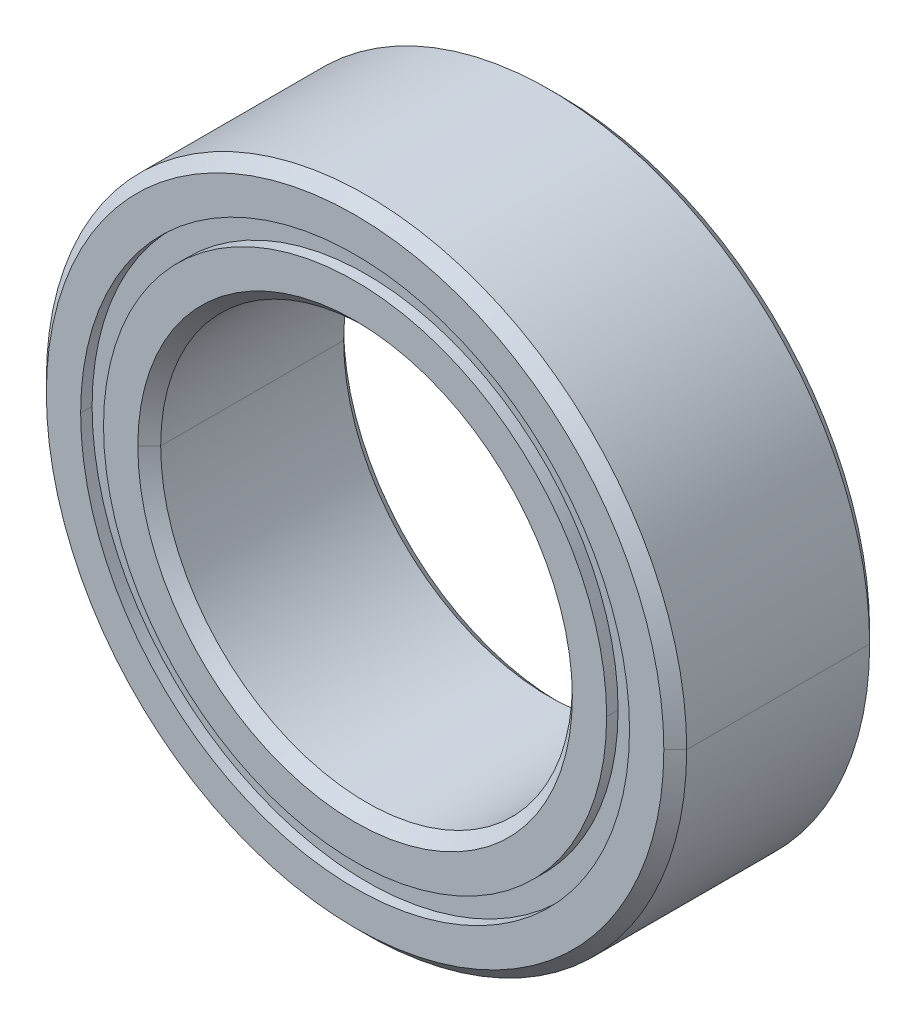
ISO-10303-21;
HEADER;
FILE_DESCRIPTION(('STEP AP214'),'2;1');
FILE_NAME('part.step','',(''),(''),'','','');
FILE_SCHEMA(('AUTOMOTIVE_DESIGN { 1 0 10303 214 1 1 1 1 }'));
ENDSEC;
DATA;
#1=APPLICATION_CONTEXT('core data for automotive mechanical design processes');
#2=APPLICATION_PROTOCOL_DEFINITION('international standard','automotive_design',2000,#1);
#3=PRODUCT_CONTEXT('',#1,'mechanical');
#4=PRODUCT('Part','Part','',(#3));
#5=PRODUCT_RELATED_PRODUCT_CATEGORY('part','',(#4));
#6=PRODUCT_DEFINITION_FORMATION('','',#4);
#7=PRODUCT_DEFINITION_CONTEXT('part definition',#1,'design');
#8=PRODUCT_DEFINITION('design','',#6,#7);
#9=PRODUCT_DEFINITION_SHAPE('','',#8);
#10=(LENGTH_UNIT() NAMED_UNIT(*) SI_UNIT(.MILLI.,.METRE.));
#11=(NAMED_UNIT(*) PLANE_ANGLE_UNIT() SI_UNIT($,.RADIAN.));
#12=(NAMED_UNIT(*) SI_UNIT($,.STERADIAN.) SOLID_ANGLE_UNIT());
#13=UNCERTAINTY_MEASURE_WITH_UNIT(LENGTH_MEASURE(1.E-05),#10,'distance_accuracy_value','');
#14=(GEOMETRIC_REPRESENTATION_CONTEXT(3) GLOBAL_UNCERTAINTY_ASSIGNED_CONTEXT((#13)) GLOBAL_UNIT_ASSIGNED_CONTEXT((#10,
#11,#12)) REPRESENTATION_CONTEXT('',''));
#15=CARTESIAN_POINT('',(0.,0.,0.));
#16=DIRECTION('',(0.,0.,1.));
#17=DIRECTION('',(1.,0.,0.));
#18=AXIS2_PLACEMENT_3D('',#15,#16,#17);
#19=CARTESIAN_POINT('',(0.,0.,2.25));
#20=DIRECTION('',(0.,0.,-1.));
#21=DIRECTION('',(-1.,0.,0.));
#22=AXIS2_PLACEMENT_3D('',#19,#20,#21);
#23=CONICAL_SURFACE('',#22,6.75,0.785398163397445);
#24=DIRECTION('',(0.707106781186545,0.,-0.70710678118655));
#25=VECTOR('',#24,1.);
#26=CARTESIAN_POINT('',(6.75,0.,2.25));
#27=LINE('',#26,#25);
#28=CARTESIAN_POINT('',(6.75,0.,2.25));
#29=VERTEX_POINT('',#28);
#30=CARTESIAN_POINT('',(7.,0.,2.));
#31=VERTEX_POINT('',#30);
#32=EDGE_CURVE('E227',#29,#31,#27,.T.);
#33=ORIENTED_EDGE('',*,*,#32,.F.);
#34=CARTESIAN_POINT('',(0.,0.,2.25));
#35=DIRECTION('',(0.,0.,1.));
#36=DIRECTION('',(1.,0.,0.));
#37=AXIS2_PLACEMENT_3D('',#34,#35,#36);
#38=CIRCLE('',#37,6.75);
#39=CARTESIAN_POINT('',(-6.75,0.,2.25));
#40=VERTEX_POINT('',#39);
#41=EDGE_CURVE('E201',#40,#29,#38,.T.);
#42=ORIENTED_EDGE('',*,*,#41,.F.);
#43=DIRECTION('',(-0.707106781186545,0.,-0.70710678118655));
#44=VECTOR('',#43,1.);
#45=CARTESIAN_POINT('',(-6.75,0.,2.25));
#46=LINE('',#45,#44);
#47=CARTESIAN_POINT('',(-7.,0.,2.));
#48=VERTEX_POINT('',#47);
#49=EDGE_CURVE('E241',#40,#48,#46,.T.);
#50=ORIENTED_EDGE('',*,*,#49,.T.);
#51=CARTESIAN_POINT('',(0.,0.,2.));
#52=DIRECTION('',(0.,0.,-1.));
#53=DIRECTION('',(1.,0.,0.));
#54=AXIS2_PLACEMENT_3D('',#51,#52,#53);
#55=CIRCLE('',#54,7.);
#56=EDGE_CURVE('E122',#31,#48,#55,.T.);
#57=ORIENTED_EDGE('',*,*,#56,.F.);
#58=EDGE_LOOP('',(#33,#42,#50,#57));
#59=FACE_BOUND('',#58,.T.);
#60=ADVANCED_FACE('F17',(#59),#23,.T.);
#61=CARTESIAN_POINT('',(0.,0.,-2.));
#62=DIRECTION('',(0.,0.,1.));
#63=DIRECTION('',(1.,0.,0.));
#64=AXIS2_PLACEMENT_3D('',#61,#62,#63);
#65=CONICAL_SURFACE('',#64,7.,0.78539816339745);
#66=DIRECTION('',(-0.707106781186549,0.,0.707106781186546));
#67=VECTOR('',#66,1.);
#68=CARTESIAN_POINT('',(-7.,0.,-2.));
#69=LINE('',#68,#67);
#70=CARTESIAN_POINT('',(-6.75,0.,-2.25));
#71=VERTEX_POINT('',#70);
#72=CARTESIAN_POINT('',(-7.,0.,-2.));
#73=VERTEX_POINT('',#72);
#74=EDGE_CURVE('E147',#71,#73,#69,.T.);
#75=ORIENTED_EDGE('',*,*,#74,.F.);
#76=CARTESIAN_POINT('',(0.,0.,-2.25));
#77=DIRECTION('',(0.,0.,-1.));
#78=DIRECTION('',(1.,0.,0.));
#79=AXIS2_PLACEMENT_3D('',#76,#77,#78);
#80=CIRCLE('',#79,6.75);
#81=CARTESIAN_POINT('',(6.75,0.,-2.25));
#82=VERTEX_POINT('',#81);
#83=EDGE_CURVE('E139',#82,#71,#80,.T.);
#84=ORIENTED_EDGE('',*,*,#83,.F.);
#85=DIRECTION('',(0.707106781186549,0.,0.707106781186546));
#86=VECTOR('',#85,1.);
#87=CARTESIAN_POINT('',(7.,0.,-2.));
#88=LINE('',#87,#86);
#89=CARTESIAN_POINT('',(7.,0.,-2.));
#90=VERTEX_POINT('',#89);
#91=EDGE_CURVE('E136',#82,#90,#88,.T.);
#92=ORIENTED_EDGE('',*,*,#91,.T.);
#93=CARTESIAN_POINT('',(0.,0.,-2.));
#94=DIRECTION('',(0.,0.,1.));
#95=DIRECTION('',(1.,0.,0.));
#96=AXIS2_PLACEMENT_3D('',#93,#94,#95);
#97=CIRCLE('',#96,7.);
#98=EDGE_CURVE('E108',#73,#90,#97,.T.);
#99=ORIENTED_EDGE('',*,*,#98,.F.);
#100=EDGE_LOOP('',(#75,#84,#92,#99));
#101=FACE_BOUND('',#100,.T.);
#102=ADVANCED_FACE('F137',(#101),#65,.T.);
#103=CARTESIAN_POINT('',(0.,0.,2.));
#104=DIRECTION('',(0.,0.,1.));
#105=DIRECTION('',(1.,0.,0.));
#106=AXIS2_PLACEMENT_3D('',#103,#104,#105);
#107=CONICAL_SURFACE('',#106,4.5,0.785398163397452);
#108=DIRECTION('',(-0.70710678118655,0.,0.707106781186545));
#109=VECTOR('',#108,1.);
#110=CARTESIAN_POINT('',(-4.5,0.,2.));
#111=LINE('',#110,#109);
#112=CARTESIAN_POINT('',(-4.5,0.,2.));
#113=VERTEX_POINT('',#112);
#114=CARTESIAN_POINT('',(-4.75,0.,2.25));
#115=VERTEX_POINT('',#114);
#116=EDGE_CURVE('E183',#113,#115,#111,.T.);
#117=ORIENTED_EDGE('',*,*,#116,.F.);
#118=CARTESIAN_POINT('',(0.,0.,2.));
#119=DIRECTION('',(0.,0.,1.));
#120=DIRECTION('',(1.,0.,0.));
#121=AXIS2_PLACEMENT_3D('',#118,#119,#120);
#122=CIRCLE('',#121,4.5);
#123=CARTESIAN_POINT('',(4.5,0.,2.));
#124=VERTEX_POINT('',#123);
#125=EDGE_CURVE('E121',#124,#113,#122,.T.);
#126=ORIENTED_EDGE('',*,*,#125,.F.);
#127=DIRECTION('',(0.70710678118655,0.,0.707106781186545));
#128=VECTOR('',#127,1.);
#129=CARTESIAN_POINT('',(4.5,0.,2.));
#130=LINE('',#129,#128);
#131=CARTESIAN_POINT('',(4.75,0.,2.25));
#132=VERTEX_POINT('',#131);
#133=EDGE_CURVE('E238',#124,#132,#130,.T.);
#134=ORIENTED_EDGE('',*,*,#133,.T.);
#135=CARTESIAN_POINT('',(0.,0.,2.25));
#136=DIRECTION('',(0.,0.,-1.));
#137=DIRECTION('',(1.,0.,0.));
#138=AXIS2_PLACEMENT_3D('',#135,#136,#137);
#139=CIRCLE('',#138,4.75);
#140=EDGE_CURVE('E205',#115,#132,#139,.T.);
#141=ORIENTED_EDGE('',*,*,#140,.F.);
#142=EDGE_LOOP('',(#117,#126,#134,#141));
#143=FACE_BOUND('',#142,.T.);
#144=ADVANCED_FACE('F419',(#143),#107,.F.);
#145=CARTESIAN_POINT('',(0.,0.,-2.25));
#146=DIRECTION('',(0.,0.,-1.));
#147=DIRECTION('',(-1.,0.,0.));
#148=AXIS2_PLACEMENT_3D('',#145,#146,#147);
#149=CONICAL_SURFACE('',#148,4.75,0.785398163397448);
#150=DIRECTION('',(0.707106781186548,0.,-0.707106781186548));
#151=VECTOR('',#150,1.);
#152=CARTESIAN_POINT('',(4.75,0.,-2.25));
#153=LINE('',#152,#151);
#154=CARTESIAN_POINT('',(4.5,0.,-2.));
#155=VERTEX_POINT('',#154);
#156=CARTESIAN_POINT('',(4.75,0.,-2.25));
#157=VERTEX_POINT('',#156);
#158=EDGE_CURVE('E206',#155,#157,#153,.T.);
#159=ORIENTED_EDGE('',*,*,#158,.F.);
#160=CARTESIAN_POINT('',(0.,0.,-2.));
#161=DIRECTION('',(0.,0.,-1.));
#162=DIRECTION('',(1.,0.,0.));
#163=AXIS2_PLACEMENT_3D('',#160,#161,#162);
#164=CIRCLE('',#163,4.5);
#165=CARTESIAN_POINT('',(-4.5,0.,-2.));
#166=VERTEX_POINT('',#165);
#167=EDGE_CURVE('E166',#166,#155,#164,.T.);
#168=ORIENTED_EDGE('',*,*,#167,.F.);
#169=DIRECTION('',(-0.707106781186548,0.,-0.707106781186548));
#170=VECTOR('',#169,1.);
#171=CARTESIAN_POINT('',(-4.75,0.,-2.25));
#172=LINE('',#171,#170);
#173=CARTESIAN_POINT('',(-4.75,0.,-2.25));
#174=VERTEX_POINT('',#173);
#175=EDGE_CURVE('E192',#166,#174,#172,.T.);
#176=ORIENTED_EDGE('',*,*,#175,.T.);
#177=CARTESIAN_POINT('',(0.,0.,-2.25));
#178=DIRECTION('',(0.,0.,1.));
#179=DIRECTION('',(1.,0.,0.));
#180=AXIS2_PLACEMENT_3D('',#177,#178,#179);
#181=CIRCLE('',#180,4.75);
#182=EDGE_CURVE('E257',#157,#174,#181,.T.);
#183=ORIENTED_EDGE('',*,*,#182,.F.);
#184=EDGE_LOOP('',(#159,#168,#176,#183));
#185=FACE_BOUND('',#184,.T.);
#186=ADVANCED_FACE('F314',(#185),#149,.F.);
#187=CARTESIAN_POINT('',(0.,0.,-2.));
#188=DIRECTION('',(0.,0.,-1.));
#189=DIRECTION('',(-1.,0.,0.));
#190=AXIS2_PLACEMENT_3D('',#187,#188,#189);
#191=CYLINDRICAL_SURFACE('',#190,5.5);
#192=DIRECTION('',(0.,0.,-1.));
#193=VECTOR('',#192,1.);
#194=CARTESIAN_POINT('',(5.5,0.,-2.));
#195=LINE('',#194,#193);
#196=CARTESIAN_POINT('',(5.5,0.,-2.));
#197=VERTEX_POINT('',#196);
#198=CARTESIAN_POINT('',(5.5,0.,-2.25));
#199=VERTEX_POINT('',#198);
#200=EDGE_CURVE('E191',#197,#199,#195,.T.);
#201=ORIENTED_EDGE('',*,*,#200,.F.);
#202=CARTESIAN_POINT('',(0.,0.,-2.));
#203=DIRECTION('',(0.,0.,1.));
#204=DIRECTION('',(1.,0.,0.));
#205=AXIS2_PLACEMENT_3D('',#202,#203,#204);
#206=CIRCLE('',#205,5.5);
#207=CARTESIAN_POINT('',(-5.5,0.,-2.));
#208=VERTEX_POINT('',#207);
#209=EDGE_CURVE('E11',#208,#197,#206,.T.);
#210=ORIENTED_EDGE('',*,*,#209,.F.);
#211=DIRECTION('',(0.,0.,-1.));
#212=VECTOR('',#211,1.);
#213=CARTESIAN_POINT('',(-5.5,0.,-2.));
#214=LINE('',#213,#212);
#215=CARTESIAN_POINT('',(-5.5,0.,-2.25));
#216=VERTEX_POINT('',#215);
#217=EDGE_CURVE('E222',#208,#216,#214,.T.);
#218=ORIENTED_EDGE('',*,*,#217,.T.);
#219=CARTESIAN_POINT('',(0.,0.,-2.25));
#220=DIRECTION('',(0.,0.,1.));
#221=DIRECTION('',(1.,0.,0.));
#222=AXIS2_PLACEMENT_3D('',#219,#220,#221);
#223=CIRCLE('',#222,5.5);
#224=EDGE_CURVE('E272',#216,#199,#223,.T.);
#225=ORIENTED_EDGE('',*,*,#224,.T.);
#226=EDGE_LOOP('',(#201,#210,#218,#225));
#227=FACE_BOUND('',#226,.T.);
#228=ADVANCED_FACE('F588',(#227),#191,.T.);
#229=CARTESIAN_POINT('',(0.,0.,-2.));
#230=DIRECTION('',(0.,0.,-1.));
#231=DIRECTION('',(-1.,0.,0.));
#232=AXIS2_PLACEMENT_3D('',#229,#230,#231);
#233=CYLINDRICAL_SURFACE('',#232,6.);
#234=DIRECTION('',(0.,0.,-1.));
#235=VECTOR('',#234,1.);
#236=CARTESIAN_POINT('',(6.,0.,-2.));
#237=LINE('',#236,#235);
#238=CARTESIAN_POINT('',(6.,0.,-2.));
#239=VERTEX_POINT('',#238);
#240=CARTESIAN_POINT('',(6.,0.,-2.25));
#241=VERTEX_POINT('',#240);
#242=EDGE_CURVE('E163',#239,#241,#237,.T.);
#243=ORIENTED_EDGE('',*,*,#242,.F.);
#244=CARTESIAN_POINT('',(0.,0.,-2.));
#245=DIRECTION('',(0.,0.,1.));
#246=DIRECTION('',(1.,0.,0.));
#247=AXIS2_PLACEMENT_3D('',#244,#245,#246);
#248=CIRCLE('',#247,6.);
#249=CARTESIAN_POINT('',(-6.,0.,-2.));
#250=VERTEX_POINT('',#249);
#251=EDGE_CURVE('E28',#239,#250,#248,.T.);
#252=ORIENTED_EDGE('',*,*,#251,.T.);
#253=DIRECTION('',(0.,0.,-1.));
#254=VECTOR('',#253,1.);
#255=CARTESIAN_POINT('',(-6.,0.,-2.));
#256=LINE('',#255,#254);
#257=CARTESIAN_POINT('',(-6.,0.,-2.25));
#258=VERTEX_POINT('',#257);
#259=EDGE_CURVE('E162',#250,#258,#256,.T.);
#260=ORIENTED_EDGE('',*,*,#259,.T.);
#261=CARTESIAN_POINT('',(0.,0.,-2.25));
#262=DIRECTION('',(0.,0.,1.));
#263=DIRECTION('',(1.,0.,0.));
#264=AXIS2_PLACEMENT_3D('',#261,#262,#263);
#265=CIRCLE('',#264,6.);
#266=EDGE_CURVE('E21',#241,#258,#265,.T.);
#267=ORIENTED_EDGE('',*,*,#266,.F.);
#268=EDGE_LOOP('',(#243,#252,#260,#267));
#269=FACE_BOUND('',#268,.T.);
#270=ADVANCED_FACE('F341',(#269),#233,.F.);
#271=CARTESIAN_POINT('',(0.,0.,-2.));
#272=DIRECTION('',(0.,0.,-1.));
#273=DIRECTION('',(0.,-1.,0.));
#274=AXIS2_PLACEMENT_3D('',#271,#272,#273);
#275=PLANE('',#274);
#276=ORIENTED_EDGE('',*,*,#209,.T.);
#277=CARTESIAN_POINT('',(0.,0.,-2.));
#278=DIRECTION('',(0.,0.,1.));
#279=DIRECTION('',(1.,0.,0.));
#280=AXIS2_PLACEMENT_3D('',#277,#278,#279);
#281=CIRCLE('',#280,5.5);
#282=EDGE_CURVE('E188',#197,#208,#281,.T.);
#283=ORIENTED_EDGE('',*,*,#282,.T.);
#284=EDGE_LOOP('',(#276,#283));
#285=FACE_BOUND('',#284,.T.);
#286=CARTESIAN_POINT('',(0.,0.,-2.));
#287=DIRECTION('',(0.,0.,1.));
#288=DIRECTION('',(1.,0.,0.));
#289=AXIS2_PLACEMENT_3D('',#286,#287,#288);
#290=CIRCLE('',#289,6.);
#291=EDGE_CURVE('E218',#250,#239,#290,.T.);
#292=ORIENTED_EDGE('',*,*,#291,.F.);
#293=ORIENTED_EDGE('',*,*,#251,.F.);
#294=EDGE_LOOP('',(#292,#293));
#295=FACE_BOUND('',#294,.T.);
#296=ADVANCED_FACE('F621',(#285,#295),#275,.T.);
#297=CARTESIAN_POINT('',(0.,0.,2.));
#298=DIRECTION('',(0.,0.,1.));
#299=DIRECTION('',(1.,0.,0.));
#300=AXIS2_PLACEMENT_3D('',#297,#298,#299);
#301=CYLINDRICAL_SURFACE('',#300,5.5);
#302=DIRECTION('',(0.,0.,1.));
#303=VECTOR('',#302,1.);
#304=CARTESIAN_POINT('',(-5.5,0.,2.));
#305=LINE('',#304,#303);
#306=CARTESIAN_POINT('',(-5.5,0.,2.));
#307=VERTEX_POINT('',#306);
#308=CARTESIAN_POINT('',(-5.5,0.,2.25));
#309=VERTEX_POINT('',#308);
#310=EDGE_CURVE('E171',#307,#309,#305,.T.);
#311=ORIENTED_EDGE('',*,*,#310,.F.);
#312=CARTESIAN_POINT('',(0.,0.,2.));
#313=DIRECTION('',(0.,0.,1.));
#314=DIRECTION('',(1.,0.,0.));
#315=AXIS2_PLACEMENT_3D('',#312,#313,#314);
#316=CIRCLE('',#315,5.5);
#317=CARTESIAN_POINT('',(5.5,0.,2.));
#318=VERTEX_POINT('',#317);
#319=EDGE_CURVE('E176',#307,#318,#316,.T.);
#320=ORIENTED_EDGE('',*,*,#319,.T.);
#321=DIRECTION('',(0.,0.,1.));
#322=VECTOR('',#321,1.);
#323=CARTESIAN_POINT('',(5.5,0.,2.));
#324=LINE('',#323,#322);
#325=CARTESIAN_POINT('',(5.5,0.,2.25));
#326=VERTEX_POINT('',#325);
#327=EDGE_CURVE('E217',#318,#326,#324,.T.);
#328=ORIENTED_EDGE('',*,*,#327,.T.);
#329=CARTESIAN_POINT('',(0.,0.,2.25));
#330=DIRECTION('',(0.,0.,1.));
#331=DIRECTION('',(1.,0.,0.));
#332=AXIS2_PLACEMENT_3D('',#329,#330,#331);
#333=CIRCLE('',#332,5.5);
#334=EDGE_CURVE('E252',#309,#326,#333,.T.);
#335=ORIENTED_EDGE('',*,*,#334,.F.);
#336=EDGE_LOOP('',(#311,#320,#328,#335));
#337=FACE_BOUND('',#336,.T.);
#338=ADVANCED_FACE('F429',(#337),#301,.T.);
#339=CARTESIAN_POINT('',(0.,0.,2.));
#340=DIRECTION('',(0.,0.,1.));
#341=DIRECTION('',(1.,0.,0.));
#342=AXIS2_PLACEMENT_3D('',#339,#340,#341);
#343=PLANE('',#342);
#344=CARTESIAN_POINT('',(0.,0.,2.));
#345=DIRECTION('',(0.,0.,1.));
#346=DIRECTION('',(1.,0.,0.));
#347=AXIS2_PLACEMENT_3D('',#344,#345,#346);
#348=CIRCLE('',#347,5.5);
#349=EDGE_CURVE('E167',#318,#307,#348,.T.);
#350=ORIENTED_EDGE('',*,*,#349,.F.);
#351=ORIENTED_EDGE('',*,*,#319,.F.);
#352=EDGE_LOOP('',(#350,#351));
#353=FACE_BOUND('',#352,.T.);
#354=CARTESIAN_POINT('',(0.,0.,2.));
#355=DIRECTION('',(0.,0.,1.));
#356=DIRECTION('',(1.,0.,0.));
#357=AXIS2_PLACEMENT_3D('',#354,#355,#356);
#358=CIRCLE('',#357,6.);
#359=CARTESIAN_POINT('',(6.,0.,2.));
#360=VERTEX_POINT('',#359);
#361=CARTESIAN_POINT('',(-6.,0.,2.));
#362=VERTEX_POINT('',#361);
#363=EDGE_CURVE('E180',#360,#362,#358,.T.);
#364=ORIENTED_EDGE('',*,*,#363,.T.);
#365=CARTESIAN_POINT('',(0.,0.,2.));
#366=DIRECTION('',(0.,0.,1.));
#367=DIRECTION('',(1.,0.,0.));
#368=AXIS2_PLACEMENT_3D('',#365,#366,#367);
#369=CIRCLE('',#368,6.);
#370=EDGE_CURVE('E212',#362,#360,#369,.T.);
#371=ORIENTED_EDGE('',*,*,#370,.T.);
#372=EDGE_LOOP('',(#364,#371));
#373=FACE_BOUND('',#372,.T.);
#374=ADVANCED_FACE('F431',(#353,#373),#343,.T.);
#375=CARTESIAN_POINT('',(0.,0.,2.));
#376=DIRECTION('',(0.,0.,1.));
#377=DIRECTION('',(1.,0.,0.));
#378=AXIS2_PLACEMENT_3D('',#375,#376,#377);
#379=CYLINDRICAL_SURFACE('',#378,6.);
#380=DIRECTION('',(0.,0.,1.));
#381=VECTOR('',#380,1.);
#382=CARTESIAN_POINT('',(-6.,0.,2.));
#383=LINE('',#382,#381);
#384=CARTESIAN_POINT('',(-6.,0.,2.25));
#385=VERTEX_POINT('',#384);
#386=EDGE_CURVE('E216',#362,#385,#383,.T.);
#387=ORIENTED_EDGE('',*,*,#386,.F.);
#388=ORIENTED_EDGE('',*,*,#363,.F.);
#389=DIRECTION('',(0.,0.,1.));
#390=VECTOR('',#389,1.);
#391=CARTESIAN_POINT('',(6.,0.,2.));
#392=LINE('',#391,#390);
#393=CARTESIAN_POINT('',(6.,0.,2.25));
#394=VERTEX_POINT('',#393);
#395=EDGE_CURVE('E228',#360,#394,#392,.T.);
#396=ORIENTED_EDGE('',*,*,#395,.T.);
#397=CARTESIAN_POINT('',(0.,0.,2.25));
#398=DIRECTION('',(0.,0.,1.));
#399=DIRECTION('',(1.,0.,0.));
#400=AXIS2_PLACEMENT_3D('',#397,#398,#399);
#401=CIRCLE('',#400,6.);
#402=EDGE_CURVE('E42',#394,#385,#401,.T.);
#403=ORIENTED_EDGE('',*,*,#402,.T.);
#404=EDGE_LOOP('',(#387,#388,#396,#403));
#405=FACE_BOUND('',#404,.T.);
#406=ADVANCED_FACE('F434',(#405),#379,.F.);
#407=CARTESIAN_POINT('',(0.,0.,2.25));
#408=DIRECTION('',(0.,0.,-1.));
#409=DIRECTION('',(-1.,0.,0.));
#410=AXIS2_PLACEMENT_3D('',#407,#408,#409);
#411=CYLINDRICAL_SURFACE('',#410,4.5);
#412=DIRECTION('',(0.,0.,-1.));
#413=VECTOR('',#412,1.);
#414=CARTESIAN_POINT('',(4.5,0.,2.25));
#415=LINE('',#414,#413);
#416=EDGE_CURVE('E175',#124,#155,#415,.T.);
#417=ORIENTED_EDGE('',*,*,#416,.F.);
#418=ORIENTED_EDGE('',*,*,#125,.T.);
#419=DIRECTION('',(0.,0.,-1.));
#420=VECTOR('',#419,1.);
#421=CARTESIAN_POINT('',(-4.5,0.,2.25));
#422=LINE('',#421,#420);
#423=EDGE_CURVE('E133',#113,#166,#422,.T.);
#424=ORIENTED_EDGE('',*,*,#423,.T.);
#425=ORIENTED_EDGE('',*,*,#167,.T.);
#426=EDGE_LOOP('',(#417,#418,#424,#425));
#427=FACE_BOUND('',#426,.T.);
#428=ADVANCED_FACE('F408',(#427),#411,.F.);
#429=CARTESIAN_POINT('',(0.,0.,2.25));
#430=DIRECTION('',(0.,0.,-1.));
#431=DIRECTION('',(-1.,0.,0.));
#432=AXIS2_PLACEMENT_3D('',#429,#430,#431);
#433=CYLINDRICAL_SURFACE('',#432,7.);
#434=DIRECTION('',(0.,0.,-1.));
#435=VECTOR('',#434,1.);
#436=CARTESIAN_POINT('',(7.,0.,2.25));
#437=LINE('',#436,#435);
#438=EDGE_CURVE('E112',#31,#90,#437,.T.);
#439=ORIENTED_EDGE('',*,*,#438,.F.);
#440=ORIENTED_EDGE('',*,*,#56,.T.);
#441=DIRECTION('',(0.,0.,-1.));
#442=VECTOR('',#441,1.);
#443=CARTESIAN_POINT('',(-7.,0.,2.25));
#444=LINE('',#443,#442);
#445=EDGE_CURVE('E115',#48,#73,#444,.T.);
#446=ORIENTED_EDGE('',*,*,#445,.T.);
#447=ORIENTED_EDGE('',*,*,#98,.T.);
#448=EDGE_LOOP('',(#439,#440,#446,#447));
#449=FACE_BOUND('',#448,.T.);
#450=ADVANCED_FACE('F110',(#449),#433,.T.);
#451=CARTESIAN_POINT('',(0.,0.,-2.25));
#452=DIRECTION('',(0.,0.,1.));
#453=DIRECTION('',(1.,0.,0.));
#454=AXIS2_PLACEMENT_3D('',#451,#452,#453);
#455=PLANE('',#454);
#456=CARTESIAN_POINT('',(0.,0.,-2.25));
#457=DIRECTION('',(0.,0.,1.));
#458=DIRECTION('',(1.,0.,0.));
#459=AXIS2_PLACEMENT_3D('',#456,#457,#458);
#460=CIRCLE('',#459,6.);
#461=EDGE_CURVE('E158',#258,#241,#460,.T.);
#462=ORIENTED_EDGE('',*,*,#461,.T.);
#463=ORIENTED_EDGE('',*,*,#266,.T.);
#464=EDGE_LOOP('',(#462,#463));
#465=FACE_BOUND('',#464,.T.);
#466=ORIENTED_EDGE('',*,*,#83,.T.);
#467=CARTESIAN_POINT('',(0.,0.,-2.25));
#468=DIRECTION('',(0.,0.,-1.));
#469=DIRECTION('',(1.,0.,0.));
#470=AXIS2_PLACEMENT_3D('',#467,#468,#469);
#471=CIRCLE('',#470,6.75);
#472=EDGE_CURVE('E154',#71,#82,#471,.T.);
#473=ORIENTED_EDGE('',*,*,#472,.T.);
#474=EDGE_LOOP('',(#466,#473));
#475=FACE_BOUND('',#474,.T.);
#476=ADVANCED_FACE('F336',(#465,#475),#455,.F.);
#477=CARTESIAN_POINT('',(0.,0.,2.25));
#478=DIRECTION('',(0.,0.,1.));
#479=DIRECTION('',(1.,0.,0.));
#480=AXIS2_PLACEMENT_3D('',#477,#478,#479);
#481=PLANE('',#480);
#482=ORIENTED_EDGE('',*,*,#402,.F.);
#483=CARTESIAN_POINT('',(0.,0.,2.25));
#484=DIRECTION('',(0.,0.,1.));
#485=DIRECTION('',(1.,0.,0.));
#486=AXIS2_PLACEMENT_3D('',#483,#484,#485);
#487=CIRCLE('',#486,6.);
#488=EDGE_CURVE('E231',#385,#394,#487,.T.);
#489=ORIENTED_EDGE('',*,*,#488,.F.);
#490=EDGE_LOOP('',(#482,#489));
#491=FACE_BOUND('',#490,.T.);
#492=ORIENTED_EDGE('',*,*,#41,.T.);
#493=CARTESIAN_POINT('',(0.,0.,2.25));
#494=DIRECTION('',(0.,0.,1.));
#495=DIRECTION('',(1.,0.,0.));
#496=AXIS2_PLACEMENT_3D('',#493,#494,#495);
#497=CIRCLE('',#496,6.75);
#498=EDGE_CURVE('E223',#29,#40,#497,.T.);
#499=ORIENTED_EDGE('',*,*,#498,.T.);
#500=EDGE_LOOP('',(#492,#499));
#501=FACE_BOUND('',#500,.T.);
#502=ADVANCED_FACE('F390',(#491,#501),#481,.T.);
#503=CARTESIAN_POINT('',(0.,0.,2.25));
#504=DIRECTION('',(0.,0.,1.));
#505=DIRECTION('',(1.,0.,0.));
#506=AXIS2_PLACEMENT_3D('',#503,#504,#505);
#507=PLANE('',#506);
#508=CARTESIAN_POINT('',(0.,0.,2.25));
#509=DIRECTION('',(0.,0.,-1.));
#510=DIRECTION('',(1.,0.,0.));
#511=AXIS2_PLACEMENT_3D('',#508,#509,#510);
#512=CIRCLE('',#511,4.75);
#513=EDGE_CURVE('E187',#132,#115,#512,.T.);
#514=ORIENTED_EDGE('',*,*,#513,.T.);
#515=ORIENTED_EDGE('',*,*,#140,.T.);
#516=EDGE_LOOP('',(#514,#515));
#517=FACE_BOUND('',#516,.T.);
#518=CARTESIAN_POINT('',(0.,0.,2.25));
#519=DIRECTION('',(0.,0.,1.));
#520=DIRECTION('',(1.,0.,0.));
#521=AXIS2_PLACEMENT_3D('',#518,#519,#520);
#522=CIRCLE('',#521,5.5);
#523=EDGE_CURVE('E197',#326,#309,#522,.T.);
#524=ORIENTED_EDGE('',*,*,#523,.T.);
#525=ORIENTED_EDGE('',*,*,#334,.T.);
#526=EDGE_LOOP('',(#524,#525));
#527=FACE_BOUND('',#526,.T.);
#528=ADVANCED_FACE('F421',(#517,#527),#507,.T.);
#529=CARTESIAN_POINT('',(0.,0.,-2.25));
#530=DIRECTION('',(0.,0.,1.));
#531=DIRECTION('',(1.,0.,0.));
#532=AXIS2_PLACEMENT_3D('',#529,#530,#531);
#533=PLANE('',#532);
#534=CARTESIAN_POINT('',(0.,0.,-2.25));
#535=DIRECTION('',(0.,0.,1.));
#536=DIRECTION('',(1.,0.,0.));
#537=AXIS2_PLACEMENT_3D('',#534,#535,#536);
#538=CIRCLE('',#537,4.75);
#539=EDGE_CURVE('E210',#174,#157,#538,.T.);
#540=ORIENTED_EDGE('',*,*,#539,.T.);
#541=ORIENTED_EDGE('',*,*,#182,.T.);
#542=EDGE_LOOP('',(#540,#541));
#543=FACE_BOUND('',#542,.T.);
#544=ORIENTED_EDGE('',*,*,#224,.F.);
#545=CARTESIAN_POINT('',(0.,0.,-2.25));
#546=DIRECTION('',(0.,0.,1.));
#547=DIRECTION('',(1.,0.,0.));
#548=AXIS2_PLACEMENT_3D('',#545,#546,#547);
#549=CIRCLE('',#548,5.5);
#550=EDGE_CURVE('E324',#199,#216,#549,.T.);
#551=ORIENTED_EDGE('',*,*,#550,.F.);
#552=EDGE_LOOP('',(#544,#551));
#553=FACE_BOUND('',#552,.T.);
#554=ADVANCED_FACE('F304',(#543,#553),#533,.F.);
#555=CARTESIAN_POINT('',(0.,0.,2.25));
#556=DIRECTION('',(0.,0.,-1.));
#557=DIRECTION('',(-1.,0.,0.));
#558=AXIS2_PLACEMENT_3D('',#555,#556,#557);
#559=CYLINDRICAL_SURFACE('',#558,7.);
#560=CARTESIAN_POINT('',(0.,0.,2.));
#561=DIRECTION('',(0.,0.,-1.));
#562=DIRECTION('',(1.,0.,0.));
#563=AXIS2_PLACEMENT_3D('',#560,#561,#562);
#564=CIRCLE('',#563,7.);
#565=EDGE_CURVE('E130',#48,#31,#564,.T.);
#566=ORIENTED_EDGE('',*,*,#565,.T.);
#567=ORIENTED_EDGE('',*,*,#438,.T.);
#568=CARTESIAN_POINT('',(0.,0.,-2.));
#569=DIRECTION('',(0.,0.,1.));
#570=DIRECTION('',(1.,0.,0.));
#571=AXIS2_PLACEMENT_3D('',#568,#569,#570);
#572=CIRCLE('',#571,7.);
#573=EDGE_CURVE('E127',#90,#73,#572,.T.);
#574=ORIENTED_EDGE('',*,*,#573,.T.);
#575=ORIENTED_EDGE('',*,*,#445,.F.);
#576=EDGE_LOOP('',(#566,#567,#574,#575));
#577=FACE_BOUND('',#576,.T.);
#578=ADVANCED_FACE('F125',(#577),#559,.T.);
#579=CARTESIAN_POINT('',(0.,0.,2.25));
#580=DIRECTION('',(0.,0.,-1.));
#581=DIRECTION('',(-1.,0.,0.));
#582=AXIS2_PLACEMENT_3D('',#579,#580,#581);
#583=CYLINDRICAL_SURFACE('',#582,4.5);
#584=CARTESIAN_POINT('',(0.,0.,2.));
#585=DIRECTION('',(0.,0.,1.));
#586=DIRECTION('',(1.,0.,0.));
#587=AXIS2_PLACEMENT_3D('',#584,#585,#586);
#588=CIRCLE('',#587,4.5);
#589=EDGE_CURVE('E144',#113,#124,#588,.T.);
#590=ORIENTED_EDGE('',*,*,#589,.T.);
#591=ORIENTED_EDGE('',*,*,#416,.T.);
#592=CARTESIAN_POINT('',(0.,0.,-2.));
#593=DIRECTION('',(0.,0.,-1.));
#594=DIRECTION('',(1.,0.,0.));
#595=AXIS2_PLACEMENT_3D('',#592,#593,#594);
#596=CIRCLE('',#595,4.5);
#597=EDGE_CURVE('E211',#155,#166,#596,.T.);
#598=ORIENTED_EDGE('',*,*,#597,.T.);
#599=ORIENTED_EDGE('',*,*,#423,.F.);
#600=EDGE_LOOP('',(#590,#591,#598,#599));
#601=FACE_BOUND('',#600,.T.);
#602=ADVANCED_FACE('F412',(#601),#583,.F.);
#603=CARTESIAN_POINT('',(0.,0.,2.));
#604=DIRECTION('',(0.,0.,1.));
#605=DIRECTION('',(1.,0.,0.));
#606=AXIS2_PLACEMENT_3D('',#603,#604,#605);
#607=CYLINDRICAL_SURFACE('',#606,6.);
#608=ORIENTED_EDGE('',*,*,#370,.F.);
#609=ORIENTED_EDGE('',*,*,#386,.T.);
#610=ORIENTED_EDGE('',*,*,#488,.T.);
#611=ORIENTED_EDGE('',*,*,#395,.F.);
#612=EDGE_LOOP('',(#608,#609,#610,#611));
#613=FACE_BOUND('',#612,.T.);
#614=ADVANCED_FACE('F442',(#613),#607,.F.);
#615=CARTESIAN_POINT('',(0.,0.,2.));
#616=DIRECTION('',(0.,0.,1.));
#617=DIRECTION('',(1.,0.,0.));
#618=AXIS2_PLACEMENT_3D('',#615,#616,#617);
#619=CYLINDRICAL_SURFACE('',#618,5.5);
#620=ORIENTED_EDGE('',*,*,#349,.T.);
#621=ORIENTED_EDGE('',*,*,#310,.T.);
#622=ORIENTED_EDGE('',*,*,#523,.F.);
#623=ORIENTED_EDGE('',*,*,#327,.F.);
#624=EDGE_LOOP('',(#620,#621,#622,#623));
#625=FACE_BOUND('',#624,.T.);
#626=ADVANCED_FACE('F427',(#625),#619,.T.);
#627=CARTESIAN_POINT('',(0.,0.,-2.));
#628=DIRECTION('',(0.,0.,-1.));
#629=DIRECTION('',(-1.,0.,0.));
#630=AXIS2_PLACEMENT_3D('',#627,#628,#629);
#631=CYLINDRICAL_SURFACE('',#630,6.);
#632=ORIENTED_EDGE('',*,*,#291,.T.);
#633=ORIENTED_EDGE('',*,*,#242,.T.);
#634=ORIENTED_EDGE('',*,*,#461,.F.);
#635=ORIENTED_EDGE('',*,*,#259,.F.);
#636=EDGE_LOOP('',(#632,#633,#634,#635));
#637=FACE_BOUND('',#636,.T.);
#638=ADVANCED_FACE('F344',(#637),#631,.F.);
#639=CARTESIAN_POINT('',(0.,0.,-2.));
#640=DIRECTION('',(0.,0.,-1.));
#641=DIRECTION('',(-1.,0.,0.));
#642=AXIS2_PLACEMENT_3D('',#639,#640,#641);
#643=CYLINDRICAL_SURFACE('',#642,5.5);
#644=ORIENTED_EDGE('',*,*,#282,.F.);
#645=ORIENTED_EDGE('',*,*,#200,.T.);
#646=ORIENTED_EDGE('',*,*,#550,.T.);
#647=ORIENTED_EDGE('',*,*,#217,.F.);
#648=EDGE_LOOP('',(#644,#645,#646,#647));
#649=FACE_BOUND('',#648,.T.);
#650=ADVANCED_FACE('F578',(#649),#643,.T.);
#651=CARTESIAN_POINT('',(0.,0.,-2.25));
#652=DIRECTION('',(0.,0.,-1.));
#653=DIRECTION('',(-1.,0.,0.));
#654=AXIS2_PLACEMENT_3D('',#651,#652,#653);
#655=CONICAL_SURFACE('',#654,4.75,0.785398163397448);
#656=ORIENTED_EDGE('',*,*,#597,.F.);
#657=ORIENTED_EDGE('',*,*,#158,.T.);
#658=ORIENTED_EDGE('',*,*,#539,.F.);
#659=ORIENTED_EDGE('',*,*,#175,.F.);
#660=EDGE_LOOP('',(#656,#657,#658,#659));
#661=FACE_BOUND('',#660,.T.);
#662=ADVANCED_FACE('F19',(#661),#655,.F.);
#663=CARTESIAN_POINT('',(0.,0.,2.));
#664=DIRECTION('',(0.,0.,1.));
#665=DIRECTION('',(1.,0.,0.));
#666=AXIS2_PLACEMENT_3D('',#663,#664,#665);
#667=CONICAL_SURFACE('',#666,4.5,0.785398163397452);
#668=ORIENTED_EDGE('',*,*,#589,.F.);
#669=ORIENTED_EDGE('',*,*,#116,.T.);
#670=ORIENTED_EDGE('',*,*,#513,.F.);
#671=ORIENTED_EDGE('',*,*,#133,.F.);
#672=EDGE_LOOP('',(#668,#669,#670,#671));
#673=FACE_BOUND('',#672,.T.);
#674=ADVANCED_FACE('F416',(#673),#667,.F.);
#675=CARTESIAN_POINT('',(0.,0.,-2.));
#676=DIRECTION('',(0.,0.,1.));
#677=DIRECTION('',(1.,0.,0.));
#678=AXIS2_PLACEMENT_3D('',#675,#676,#677);
#679=CONICAL_SURFACE('',#678,7.,0.78539816339745);
#680=ORIENTED_EDGE('',*,*,#472,.F.);
#681=ORIENTED_EDGE('',*,*,#74,.T.);
#682=ORIENTED_EDGE('',*,*,#573,.F.);
#683=ORIENTED_EDGE('',*,*,#91,.F.);
#684=EDGE_LOOP('',(#680,#681,#682,#683));
#685=FACE_BOUND('',#684,.T.);
#686=ADVANCED_FACE('F146',(#685),#679,.T.);
#687=CARTESIAN_POINT('',(0.,0.,2.25));
#688=DIRECTION('',(0.,0.,-1.));
#689=DIRECTION('',(-1.,0.,0.));
#690=AXIS2_PLACEMENT_3D('',#687,#688,#689);
#691=CONICAL_SURFACE('',#690,6.75,0.785398163397445);
#692=ORIENTED_EDGE('',*,*,#498,.F.);
#693=ORIENTED_EDGE('',*,*,#32,.T.);
#694=ORIENTED_EDGE('',*,*,#565,.F.);
#695=ORIENTED_EDGE('',*,*,#49,.F.);
#696=EDGE_LOOP('',(#692,#693,#694,#695));
#697=FACE_BOUND('',#696,.T.);
#698=ADVANCED_FACE('F395',(#697),#691,.T.);
#699=CLOSED_SHELL('',(#60,#102,#144,#186,#228,#270,#296,#338,#374,#406,#428,#450,#476,#502,#528,
#554,#578,#602,#614,#626,#638,#650,#662,#674,#686,#698));
#700=MANIFOLD_SOLID_BREP('B1',#699);
#701=ADVANCED_BREP_SHAPE_REPRESENTATION('',(#18,#700),#14);
#702=SHAPE_DEFINITION_REPRESENTATION(#9,#701);
ENDSEC;
END-ISO-10303-21;
